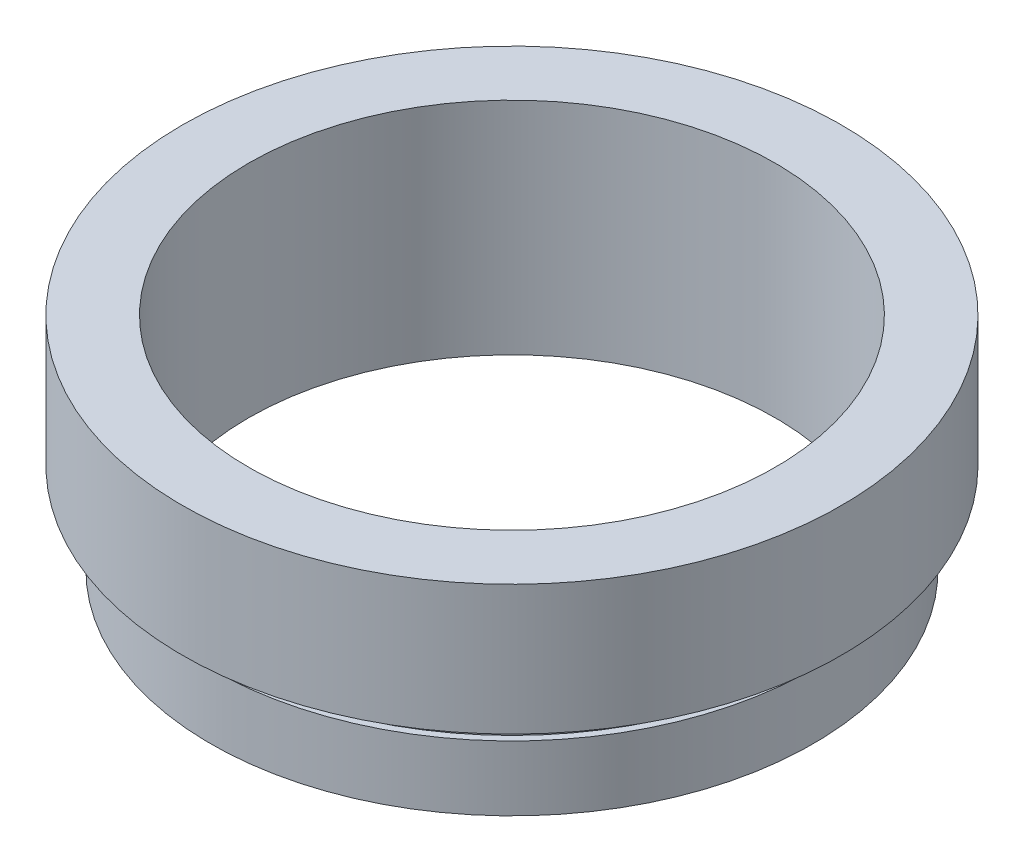
ISO-10303-21;
HEADER;
FILE_DESCRIPTION(('STEP AP214'),'2;1');
FILE_NAME('part.step','',(''),(''),'','','');
FILE_SCHEMA(('AUTOMOTIVE_DESIGN { 1 0 10303 214 1 1 1 1 }'));
ENDSEC;
DATA;
#1=APPLICATION_CONTEXT('core data for automotive mechanical design processes');
#2=APPLICATION_PROTOCOL_DEFINITION('international standard','automotive_design',2000,#1);
#3=PRODUCT_CONTEXT('',#1,'mechanical');
#4=PRODUCT('Part','Part','',(#3));
#5=PRODUCT_RELATED_PRODUCT_CATEGORY('part','',(#4));
#6=PRODUCT_DEFINITION_FORMATION('','',#4);
#7=PRODUCT_DEFINITION_CONTEXT('part definition',#1,'design');
#8=PRODUCT_DEFINITION('design','',#6,#7);
#9=PRODUCT_DEFINITION_SHAPE('','',#8);
#10=(LENGTH_UNIT() NAMED_UNIT(*) SI_UNIT(.MILLI.,.METRE.));
#11=(NAMED_UNIT(*) PLANE_ANGLE_UNIT() SI_UNIT($,.RADIAN.));
#12=(NAMED_UNIT(*) SI_UNIT($,.STERADIAN.) SOLID_ANGLE_UNIT());
#13=UNCERTAINTY_MEASURE_WITH_UNIT(LENGTH_MEASURE(1.E-05),#10,'distance_accuracy_value','');
#14=(GEOMETRIC_REPRESENTATION_CONTEXT(3) GLOBAL_UNCERTAINTY_ASSIGNED_CONTEXT((#13)) GLOBAL_UNIT_ASSIGNED_CONTEXT((#10,
#11,#12)) REPRESENTATION_CONTEXT('',''));
#15=CARTESIAN_POINT('',(0.,0.,0.));
#16=DIRECTION('',(0.,0.,1.));
#17=DIRECTION('',(1.,0.,0.));
#18=AXIS2_PLACEMENT_3D('',#15,#16,#17);
#19=CARTESIAN_POINT('',(10.15,-0.545464411119665,0.));
#20=DIRECTION('',(0.,1.,0.));
#21=DIRECTION('',(-1.,0.,0.));
#22=AXIS2_PLACEMENT_3D('',#19,#20,#21);
#23=PLANE('',#22);
#24=CARTESIAN_POINT('',(0.,-0.545464411119665,0.));
#25=DIRECTION('',(0.,1.,0.));
#26=DIRECTION('',(-1.,0.,0.));
#27=AXIS2_PLACEMENT_3D('',#24,#25,#26);
#28=CIRCLE('',#27,11.61);
#29=CARTESIAN_POINT('',(-11.61,-0.545464411119666,0.));
#30=VERTEX_POINT('',#29);
#31=EDGE_CURVE('E63',#30,#30,#28,.T.);
#32=ORIENTED_EDGE('',*,*,#31,.F.);
#33=EDGE_LOOP('',(#32));
#34=FACE_BOUND('',#33,.T.);
#35=CARTESIAN_POINT('',(0.,-0.545464411119665,0.));
#36=DIRECTION('',(0.,1.,0.));
#37=DIRECTION('',(-1.,0.,0.));
#38=AXIS2_PLACEMENT_3D('',#35,#36,#37);
#39=CIRCLE('',#38,10.15);
#40=CARTESIAN_POINT('',(-10.15,-0.545464411119666,0.));
#41=VERTEX_POINT('',#40);
#42=EDGE_CURVE('E10',#41,#41,#39,.T.);
#43=ORIENTED_EDGE('',*,*,#42,.T.);
#44=EDGE_LOOP('',(#43));
#45=FACE_BOUND('',#44,.T.);
#46=ADVANCED_FACE('F35',(#34,#45),#23,.F.);
#47=CARTESIAN_POINT('',(0.,16.8860182370821,0.));
#48=DIRECTION('',(0.,1.,0.));
#49=DIRECTION('',(-1.,0.,0.));
#50=AXIS2_PLACEMENT_3D('',#47,#48,#49);
#51=CYLINDRICAL_SURFACE('',#50,10.15);
#52=ORIENTED_EDGE('',*,*,#42,.F.);
#53=EDGE_LOOP('',(#52));
#54=FACE_BOUND('',#53,.T.);
#55=CARTESIAN_POINT('',(0.,7.95453558888033,0.));
#56=DIRECTION('',(0.,1.,0.));
#57=DIRECTION('',(-1.,0.,0.));
#58=AXIS2_PLACEMENT_3D('',#55,#56,#57);
#59=CIRCLE('',#58,10.15);
#60=CARTESIAN_POINT('',(-10.15,7.95453558888033,0.));
#61=VERTEX_POINT('',#60);
#62=EDGE_CURVE('E41',#61,#61,#59,.T.);
#63=ORIENTED_EDGE('',*,*,#62,.T.);
#64=EDGE_LOOP('',(#63));
#65=FACE_BOUND('',#64,.T.);
#66=ADVANCED_FACE('F70',(#54,#65),#51,.F.);
#67=CARTESIAN_POINT('',(10.15,7.95453558888034,0.));
#68=DIRECTION('',(0.,-1.,0.));
#69=DIRECTION('',(1.,0.,0.));
#70=AXIS2_PLACEMENT_3D('',#67,#68,#69);
#71=PLANE('',#70);
#72=ORIENTED_EDGE('',*,*,#62,.F.);
#73=EDGE_LOOP('',(#72));
#74=FACE_BOUND('',#73,.T.);
#75=CARTESIAN_POINT('',(0.,7.95453558888033,0.));
#76=DIRECTION('',(0.,1.,0.));
#77=DIRECTION('',(-1.,0.,0.));
#78=AXIS2_PLACEMENT_3D('',#75,#76,#77);
#79=CIRCLE('',#78,12.7);
#80=CARTESIAN_POINT('',(-12.7,7.95453558888033,0.));
#81=VERTEX_POINT('',#80);
#82=EDGE_CURVE('E45',#81,#81,#79,.T.);
#83=ORIENTED_EDGE('',*,*,#82,.T.);
#84=EDGE_LOOP('',(#83));
#85=FACE_BOUND('',#84,.T.);
#86=ADVANCED_FACE('F74',(#74,#85),#71,.F.);
#87=CARTESIAN_POINT('',(0.,16.8860182370821,0.));
#88=DIRECTION('',(0.,1.,0.));
#89=DIRECTION('',(-1.,0.,0.));
#90=AXIS2_PLACEMENT_3D('',#87,#88,#89);
#91=CYLINDRICAL_SURFACE('',#90,12.7);
#92=ORIENTED_EDGE('',*,*,#82,.F.);
#93=EDGE_LOOP('',(#92));
#94=FACE_BOUND('',#93,.T.);
#95=CARTESIAN_POINT('',(0.,2.95453558888033,0.));
#96=DIRECTION('',(0.,1.,0.));
#97=DIRECTION('',(-1.,0.,0.));
#98=AXIS2_PLACEMENT_3D('',#95,#96,#97);
#99=CIRCLE('',#98,12.7);
#100=CARTESIAN_POINT('',(-12.7,2.95453558888033,0.));
#101=VERTEX_POINT('',#100);
#102=EDGE_CURVE('E49',#101,#101,#99,.T.);
#103=ORIENTED_EDGE('',*,*,#102,.T.);
#104=EDGE_LOOP('',(#103));
#105=FACE_BOUND('',#104,.T.);
#106=ADVANCED_FACE('F79',(#94,#105),#91,.T.);
#107=CARTESIAN_POINT('',(11.35,2.95453558888034,0.));
#108=DIRECTION('',(0.,1.,0.));
#109=DIRECTION('',(-1.,0.,0.));
#110=AXIS2_PLACEMENT_3D('',#107,#108,#109);
#111=PLANE('',#110);
#112=ORIENTED_EDGE('',*,*,#102,.F.);
#113=EDGE_LOOP('',(#112));
#114=FACE_BOUND('',#113,.T.);
#115=CARTESIAN_POINT('',(0.,2.95453558888033,0.));
#116=DIRECTION('',(0.,1.,0.));
#117=DIRECTION('',(-1.,0.,0.));
#118=AXIS2_PLACEMENT_3D('',#115,#116,#117);
#119=CIRCLE('',#118,11.35);
#120=CARTESIAN_POINT('',(-11.35,2.95453558888033,0.));
#121=VERTEX_POINT('',#120);
#122=EDGE_CURVE('E54',#121,#121,#119,.T.);
#123=ORIENTED_EDGE('',*,*,#122,.T.);
#124=EDGE_LOOP('',(#123));
#125=FACE_BOUND('',#124,.T.);
#126=ADVANCED_FACE('F85',(#114,#125),#111,.F.);
#127=CARTESIAN_POINT('',(0.,16.8860182370821,0.));
#128=DIRECTION('',(0.,1.,0.));
#129=DIRECTION('',(-1.,0.,0.));
#130=AXIS2_PLACEMENT_3D('',#127,#128,#129);
#131=CYLINDRICAL_SURFACE('',#130,11.35);
#132=ORIENTED_EDGE('',*,*,#122,.F.);
#133=EDGE_LOOP('',(#132));
#134=FACE_BOUND('',#133,.T.);
#135=CARTESIAN_POINT('',(0.,1.95453558888033,0.));
#136=DIRECTION('',(0.,1.,0.));
#137=DIRECTION('',(-1.,0.,0.));
#138=AXIS2_PLACEMENT_3D('',#135,#136,#137);
#139=CIRCLE('',#138,11.35);
#140=CARTESIAN_POINT('',(-11.35,1.95453558888033,0.));
#141=VERTEX_POINT('',#140);
#142=EDGE_CURVE('E57',#141,#141,#139,.T.);
#143=ORIENTED_EDGE('',*,*,#142,.T.);
#144=EDGE_LOOP('',(#143));
#145=FACE_BOUND('',#144,.T.);
#146=ADVANCED_FACE('F89',(#134,#145),#131,.T.);
#147=CARTESIAN_POINT('',(11.35,1.95453558888034,0.));
#148=DIRECTION('',(0.,-1.,0.));
#149=DIRECTION('',(1.,0.,0.));
#150=AXIS2_PLACEMENT_3D('',#147,#148,#149);
#151=PLANE('',#150);
#152=ORIENTED_EDGE('',*,*,#142,.F.);
#153=EDGE_LOOP('',(#152));
#154=FACE_BOUND('',#153,.T.);
#155=CARTESIAN_POINT('',(0.,1.95453558888033,0.));
#156=DIRECTION('',(0.,1.,0.));
#157=DIRECTION('',(-1.,0.,0.));
#158=AXIS2_PLACEMENT_3D('',#155,#156,#157);
#159=CIRCLE('',#158,11.61);
#160=CARTESIAN_POINT('',(-11.61,1.95453558888033,0.));
#161=VERTEX_POINT('',#160);
#162=EDGE_CURVE('E60',#161,#161,#159,.T.);
#163=ORIENTED_EDGE('',*,*,#162,.T.);
#164=EDGE_LOOP('',(#163));
#165=FACE_BOUND('',#164,.T.);
#166=ADVANCED_FACE('F93',(#154,#165),#151,.F.);
#167=CARTESIAN_POINT('',(0.,16.8860182370821,0.));
#168=DIRECTION('',(0.,1.,0.));
#169=DIRECTION('',(-1.,0.,0.));
#170=AXIS2_PLACEMENT_3D('',#167,#168,#169);
#171=CYLINDRICAL_SURFACE('',#170,11.61);
#172=ORIENTED_EDGE('',*,*,#162,.F.);
#173=EDGE_LOOP('',(#172));
#174=FACE_BOUND('',#173,.T.);
#175=ORIENTED_EDGE('',*,*,#31,.T.);
#176=EDGE_LOOP('',(#175));
#177=FACE_BOUND('',#176,.T.);
#178=ADVANCED_FACE('F67',(#174,#177),#171,.T.);
#179=CLOSED_SHELL('',(#46,#66,#86,#106,#126,#146,#166,#178));
#180=MANIFOLD_SOLID_BREP('B2',#179);
#181=ADVANCED_BREP_SHAPE_REPRESENTATION('',(#18,#180),#14);
#182=SHAPE_DEFINITION_REPRESENTATION(#9,#181);
ENDSEC;
END-ISO-10303-21;
